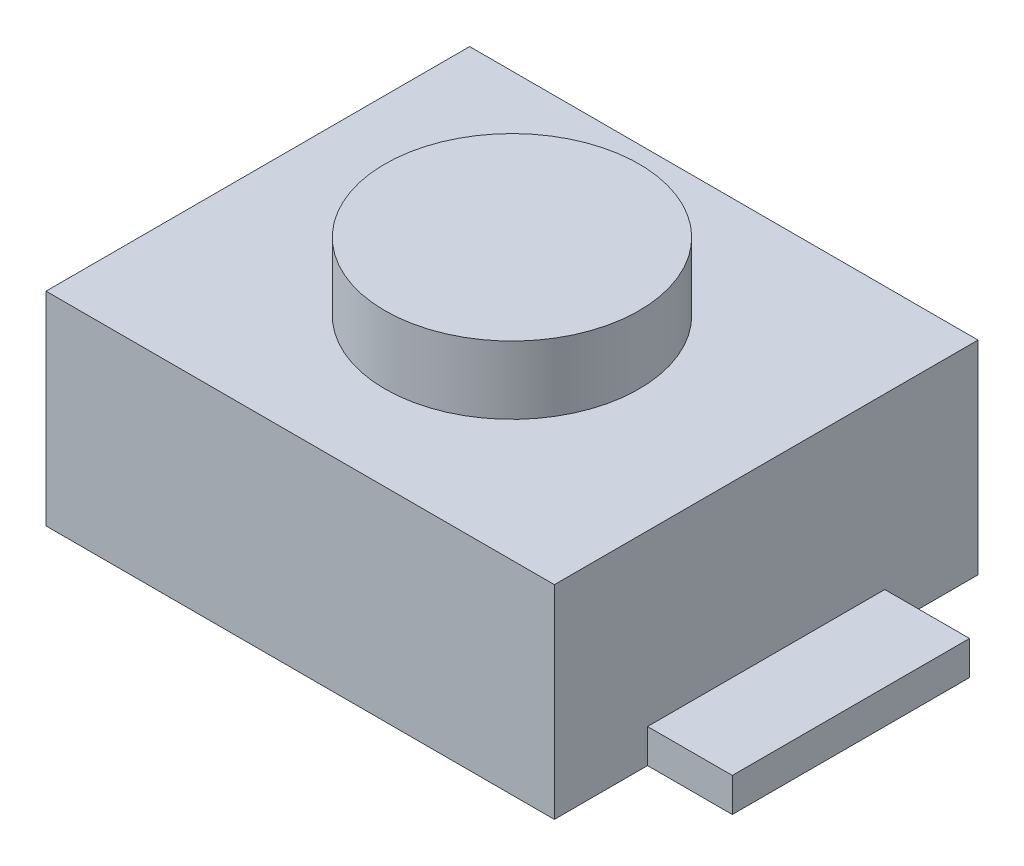
ISO-10303-21;
HEADER;
FILE_DESCRIPTION(('STEP AP214'),'2;1');
FILE_NAME('part.step','',(''),(''),'','','');
FILE_SCHEMA(('AUTOMOTIVE_DESIGN { 1 0 10303 214 1 1 1 1 }'));
ENDSEC;
DATA;
#1=APPLICATION_CONTEXT('core data for automotive mechanical design processes');
#2=APPLICATION_PROTOCOL_DEFINITION('international standard','automotive_design',2000,#1);
#3=PRODUCT_CONTEXT('',#1,'mechanical');
#4=PRODUCT('Part','Part','',(#3));
#5=PRODUCT_RELATED_PRODUCT_CATEGORY('part','',(#4));
#6=PRODUCT_DEFINITION_FORMATION('','',#4);
#7=PRODUCT_DEFINITION_CONTEXT('part definition',#1,'design');
#8=PRODUCT_DEFINITION('design','',#6,#7);
#9=PRODUCT_DEFINITION_SHAPE('','',#8);
#10=(LENGTH_UNIT() NAMED_UNIT(*) SI_UNIT(.MILLI.,.METRE.));
#11=(NAMED_UNIT(*) PLANE_ANGLE_UNIT() SI_UNIT($,.RADIAN.));
#12=(NAMED_UNIT(*) SI_UNIT($,.STERADIAN.) SOLID_ANGLE_UNIT());
#13=UNCERTAINTY_MEASURE_WITH_UNIT(LENGTH_MEASURE(1.E-05),#10,'distance_accuracy_value','');
#14=(GEOMETRIC_REPRESENTATION_CONTEXT(3) GLOBAL_UNCERTAINTY_ASSIGNED_CONTEXT((#13)) GLOBAL_UNIT_ASSIGNED_CONTEXT((#10,
#11,#12)) REPRESENTATION_CONTEXT('',''));
#15=CARTESIAN_POINT('',(0.,0.,0.));
#16=DIRECTION('',(0.,0.,1.));
#17=DIRECTION('',(1.,0.,0.));
#18=AXIS2_PLACEMENT_3D('',#15,#16,#17);
#19=CARTESIAN_POINT('',(-1.5,1.2,-1.25));
#20=DIRECTION('',(0.,0.,-1.));
#21=DIRECTION('',(-1.,0.,0.));
#22=AXIS2_PLACEMENT_3D('',#19,#20,#21);
#23=PLANE('',#22);
#24=DIRECTION('',(1.,0.,0.));
#25=VECTOR('',#24,1.);
#26=CARTESIAN_POINT('',(-1.5,0.,-1.25));
#27=LINE('',#26,#25);
#28=CARTESIAN_POINT('',(-1.5,0.,-1.25));
#29=VERTEX_POINT('',#28);
#30=CARTESIAN_POINT('',(1.5,0.,-1.25));
#31=VERTEX_POINT('',#30);
#32=EDGE_CURVE('E209',#29,#31,#27,.T.);
#33=ORIENTED_EDGE('',*,*,#32,.F.);
#34=DIRECTION('',(0.,-1.,0.));
#35=VECTOR('',#34,1.);
#36=CARTESIAN_POINT('',(-1.5,1.2,-1.25));
#37=LINE('',#36,#35);
#38=CARTESIAN_POINT('',(-1.5,1.2,-1.25));
#39=VERTEX_POINT('',#38);
#40=EDGE_CURVE('E11',#39,#29,#37,.T.);
#41=ORIENTED_EDGE('',*,*,#40,.F.);
#42=DIRECTION('',(1.,0.,0.));
#43=VECTOR('',#42,1.);
#44=CARTESIAN_POINT('',(-1.5,1.2,-1.25));
#45=LINE('',#44,#43);
#46=CARTESIAN_POINT('',(1.5,1.2,-1.25));
#47=VERTEX_POINT('',#46);
#48=EDGE_CURVE('E192',#39,#47,#45,.T.);
#49=ORIENTED_EDGE('',*,*,#48,.T.);
#50=DIRECTION('',(0.,-1.,0.));
#51=VECTOR('',#50,1.);
#52=CARTESIAN_POINT('',(1.5,1.2,-1.25));
#53=LINE('',#52,#51);
#54=EDGE_CURVE('E203',#47,#31,#53,.T.);
#55=ORIENTED_EDGE('',*,*,#54,.T.);
#56=EDGE_LOOP('',(#33,#41,#49,#55));
#57=FACE_BOUND('',#56,.T.);
#58=ADVANCED_FACE('F32',(#57),#23,.T.);
#59=CARTESIAN_POINT('',(-1.5,1.2,1.25));
#60=DIRECTION('',(-1.,0.,0.));
#61=DIRECTION('',(0.,0.,1.));
#62=AXIS2_PLACEMENT_3D('',#59,#60,#61);
#63=PLANE('',#62);
#64=DIRECTION('',(0.,1.,0.));
#65=VECTOR('',#64,1.);
#66=CARTESIAN_POINT('',(-1.5,0.2,0.7));
#67=LINE('',#66,#65);
#68=CARTESIAN_POINT('',(-1.5,0.,0.7));
#69=VERTEX_POINT('',#68);
#70=CARTESIAN_POINT('',(-1.5,0.2,0.7));
#71=VERTEX_POINT('',#70);
#72=EDGE_CURVE('E142',#69,#71,#67,.T.);
#73=ORIENTED_EDGE('',*,*,#72,.F.);
#74=DIRECTION('',(0.,0.,-1.));
#75=VECTOR('',#74,1.);
#76=CARTESIAN_POINT('',(-1.5,0.,1.25));
#77=LINE('',#76,#75);
#78=CARTESIAN_POINT('',(-1.5,0.,1.25));
#79=VERTEX_POINT('',#78);
#80=EDGE_CURVE('E188',#79,#69,#77,.T.);
#81=ORIENTED_EDGE('',*,*,#80,.F.);
#82=DIRECTION('',(0.,-1.,0.));
#83=VECTOR('',#82,1.);
#84=CARTESIAN_POINT('',(-1.5,1.2,1.25));
#85=LINE('',#84,#83);
#86=CARTESIAN_POINT('',(-1.5,1.2,1.25));
#87=VERTEX_POINT('',#86);
#88=EDGE_CURVE('E40',#87,#79,#85,.T.);
#89=ORIENTED_EDGE('',*,*,#88,.F.);
#90=DIRECTION('',(0.,0.,-1.));
#91=VECTOR('',#90,1.);
#92=CARTESIAN_POINT('',(-1.5,1.2,1.25));
#93=LINE('',#92,#91);
#94=EDGE_CURVE('E204',#87,#39,#93,.T.);
#95=ORIENTED_EDGE('',*,*,#94,.T.);
#96=ORIENTED_EDGE('',*,*,#40,.T.);
#97=CARTESIAN_POINT('',(-1.5,0.,-0.7));
#98=VERTEX_POINT('',#97);
#99=EDGE_CURVE('E53',#98,#29,#77,.T.);
#100=ORIENTED_EDGE('',*,*,#99,.F.);
#101=DIRECTION('',(0.,-1.,0.));
#102=VECTOR('',#101,1.);
#103=CARTESIAN_POINT('',(-1.5,0.,-0.7));
#104=LINE('',#103,#102);
#105=CARTESIAN_POINT('',(-1.5,0.2,-0.7));
#106=VERTEX_POINT('',#105);
#107=EDGE_CURVE('E139',#106,#98,#104,.T.);
#108=ORIENTED_EDGE('',*,*,#107,.F.);
#109=DIRECTION('',(0.,0.,-1.));
#110=VECTOR('',#109,1.);
#111=CARTESIAN_POINT('',(-1.5,0.2,-0.7));
#112=LINE('',#111,#110);
#113=EDGE_CURVE('E48',#71,#106,#112,.T.);
#114=ORIENTED_EDGE('',*,*,#113,.F.);
#115=EDGE_LOOP('',(#73,#81,#89,#95,#96,#100,#108,#114));
#116=FACE_BOUND('',#115,.T.);
#117=ADVANCED_FACE('F250',(#116),#63,.T.);
#118=CARTESIAN_POINT('',(1.5,1.2,1.25));
#119=DIRECTION('',(0.,0.,1.));
#120=DIRECTION('',(1.,0.,0.));
#121=AXIS2_PLACEMENT_3D('',#118,#119,#120);
#122=PLANE('',#121);
#123=DIRECTION('',(-1.,0.,0.));
#124=VECTOR('',#123,1.);
#125=CARTESIAN_POINT('',(1.5,0.,1.25));
#126=LINE('',#125,#124);
#127=CARTESIAN_POINT('',(1.5,0.,1.25));
#128=VERTEX_POINT('',#127);
#129=EDGE_CURVE('E196',#128,#79,#126,.T.);
#130=ORIENTED_EDGE('',*,*,#129,.F.);
#131=DIRECTION('',(0.,-1.,0.));
#132=VECTOR('',#131,1.);
#133=CARTESIAN_POINT('',(1.5,1.2,1.25));
#134=LINE('',#133,#132);
#135=CARTESIAN_POINT('',(1.5,1.2,1.25));
#136=VERTEX_POINT('',#135);
#137=EDGE_CURVE('E200',#136,#128,#134,.T.);
#138=ORIENTED_EDGE('',*,*,#137,.F.);
#139=DIRECTION('',(-1.,0.,0.));
#140=VECTOR('',#139,1.);
#141=CARTESIAN_POINT('',(1.5,1.2,1.25));
#142=LINE('',#141,#140);
#143=EDGE_CURVE('E215',#136,#87,#142,.T.);
#144=ORIENTED_EDGE('',*,*,#143,.T.);
#145=ORIENTED_EDGE('',*,*,#88,.T.);
#146=EDGE_LOOP('',(#130,#138,#144,#145));
#147=FACE_BOUND('',#146,.T.);
#148=ADVANCED_FACE('F255',(#147),#122,.T.);
#149=CARTESIAN_POINT('',(1.5,1.2,-1.25));
#150=DIRECTION('',(1.,0.,0.));
#151=DIRECTION('',(0.,0.,-1.));
#152=AXIS2_PLACEMENT_3D('',#149,#150,#151);
#153=PLANE('',#152);
#154=DIRECTION('',(0.,1.,0.));
#155=VECTOR('',#154,1.);
#156=CARTESIAN_POINT('',(1.5,0.2,-0.7));
#157=LINE('',#156,#155);
#158=CARTESIAN_POINT('',(1.5,0.,-0.7));
#159=VERTEX_POINT('',#158);
#160=CARTESIAN_POINT('',(1.5,0.2,-0.7));
#161=VERTEX_POINT('',#160);
#162=EDGE_CURVE('E156',#159,#161,#157,.T.);
#163=ORIENTED_EDGE('',*,*,#162,.F.);
#164=DIRECTION('',(0.,0.,1.));
#165=VECTOR('',#164,1.);
#166=CARTESIAN_POINT('',(1.5,0.,-1.25));
#167=LINE('',#166,#165);
#168=EDGE_CURVE('E205',#31,#159,#167,.T.);
#169=ORIENTED_EDGE('',*,*,#168,.F.);
#170=ORIENTED_EDGE('',*,*,#54,.F.);
#171=DIRECTION('',(0.,0.,1.));
#172=VECTOR('',#171,1.);
#173=CARTESIAN_POINT('',(1.5,1.2,-1.25));
#174=LINE('',#173,#172);
#175=EDGE_CURVE('E218',#47,#136,#174,.T.);
#176=ORIENTED_EDGE('',*,*,#175,.T.);
#177=ORIENTED_EDGE('',*,*,#137,.T.);
#178=CARTESIAN_POINT('',(1.5,0.,0.7));
#179=VERTEX_POINT('',#178);
#180=EDGE_CURVE('E170',#179,#128,#167,.T.);
#181=ORIENTED_EDGE('',*,*,#180,.F.);
#182=DIRECTION('',(0.,-1.,0.));
#183=VECTOR('',#182,1.);
#184=CARTESIAN_POINT('',(1.5,0.,0.7));
#185=LINE('',#184,#183);
#186=CARTESIAN_POINT('',(1.5,0.2,0.7));
#187=VERTEX_POINT('',#186);
#188=EDGE_CURVE('E146',#187,#179,#185,.T.);
#189=ORIENTED_EDGE('',*,*,#188,.F.);
#190=DIRECTION('',(0.,0.,1.));
#191=VECTOR('',#190,1.);
#192=CARTESIAN_POINT('',(1.5,0.2,0.7));
#193=LINE('',#192,#191);
#194=EDGE_CURVE('E143',#161,#187,#193,.T.);
#195=ORIENTED_EDGE('',*,*,#194,.F.);
#196=EDGE_LOOP('',(#163,#169,#170,#176,#177,#181,#189,#195));
#197=FACE_BOUND('',#196,.T.);
#198=ADVANCED_FACE('F233',(#197),#153,.T.);
#199=CARTESIAN_POINT('',(1.5,1.2,-1.25));
#200=DIRECTION('',(0.,-1.,0.));
#201=DIRECTION('',(0.,0.,-1.));
#202=AXIS2_PLACEMENT_3D('',#199,#200,#201);
#203=PLANE('',#202);
#204=CARTESIAN_POINT('',(0.,1.2,0.));
#205=DIRECTION('',(0.,1.,0.));
#206=DIRECTION('',(0.,0.,1.));
#207=AXIS2_PLACEMENT_3D('',#204,#205,#206);
#208=CIRCLE('',#207,0.75);
#209=CARTESIAN_POINT('',(0.,1.2,0.75));
#210=VERTEX_POINT('',#209);
#211=EDGE_CURVE('E269',#210,#210,#208,.T.);
#212=ORIENTED_EDGE('',*,*,#211,.F.);
#213=EDGE_LOOP('',(#212));
#214=FACE_BOUND('',#213,.T.);
#215=ORIENTED_EDGE('',*,*,#48,.F.);
#216=ORIENTED_EDGE('',*,*,#94,.F.);
#217=ORIENTED_EDGE('',*,*,#143,.F.);
#218=ORIENTED_EDGE('',*,*,#175,.F.);
#219=EDGE_LOOP('',(#215,#216,#217,#218));
#220=FACE_BOUND('',#219,.T.);
#221=ADVANCED_FACE('F248',(#214,#220),#203,.F.);
#222=CARTESIAN_POINT('',(1.5,0.,-1.25));
#223=DIRECTION('',(0.,-1.,0.));
#224=DIRECTION('',(0.,0.,-1.));
#225=AXIS2_PLACEMENT_3D('',#222,#223,#224);
#226=PLANE('',#225);
#227=ORIENTED_EDGE('',*,*,#32,.T.);
#228=ORIENTED_EDGE('',*,*,#168,.T.);
#229=DIRECTION('',(-1.,0.,0.));
#230=VECTOR('',#229,1.);
#231=CARTESIAN_POINT('',(2.,0.,-0.7));
#232=LINE('',#231,#230);
#233=CARTESIAN_POINT('',(2.,0.,-0.7));
#234=VERTEX_POINT('',#233);
#235=EDGE_CURVE('E177',#234,#159,#232,.T.);
#236=ORIENTED_EDGE('',*,*,#235,.F.);
#237=DIRECTION('',(0.,0.,-1.));
#238=VECTOR('',#237,1.);
#239=CARTESIAN_POINT('',(2.,0.,-0.7));
#240=LINE('',#239,#238);
#241=CARTESIAN_POINT('',(2.,0.,0.7));
#242=VERTEX_POINT('',#241);
#243=EDGE_CURVE('E158',#242,#234,#240,.T.);
#244=ORIENTED_EDGE('',*,*,#243,.F.);
#245=DIRECTION('',(-1.,0.,0.));
#246=VECTOR('',#245,1.);
#247=CARTESIAN_POINT('',(2.,0.,0.7));
#248=LINE('',#247,#246);
#249=EDGE_CURVE('E173',#242,#179,#248,.T.);
#250=ORIENTED_EDGE('',*,*,#249,.T.);
#251=ORIENTED_EDGE('',*,*,#180,.T.);
#252=ORIENTED_EDGE('',*,*,#129,.T.);
#253=ORIENTED_EDGE('',*,*,#80,.T.);
#254=DIRECTION('',(1.,0.,0.));
#255=VECTOR('',#254,1.);
#256=CARTESIAN_POINT('',(-2.,0.,0.7));
#257=LINE('',#256,#255);
#258=CARTESIAN_POINT('',(-2.,0.,0.7));
#259=VERTEX_POINT('',#258);
#260=EDGE_CURVE('E259',#259,#69,#257,.T.);
#261=ORIENTED_EDGE('',*,*,#260,.F.);
#262=DIRECTION('',(0.,0.,1.));
#263=VECTOR('',#262,1.);
#264=CARTESIAN_POINT('',(-2.,0.,0.7));
#265=LINE('',#264,#263);
#266=CARTESIAN_POINT('',(-2.,0.,-0.7));
#267=VERTEX_POINT('',#266);
#268=EDGE_CURVE('E135',#267,#259,#265,.T.);
#269=ORIENTED_EDGE('',*,*,#268,.F.);
#270=DIRECTION('',(1.,0.,0.));
#271=VECTOR('',#270,1.);
#272=CARTESIAN_POINT('',(-2.,0.,-0.7));
#273=LINE('',#272,#271);
#274=EDGE_CURVE('E148',#267,#98,#273,.T.);
#275=ORIENTED_EDGE('',*,*,#274,.T.);
#276=ORIENTED_EDGE('',*,*,#99,.T.);
#277=EDGE_LOOP('',(#227,#228,#236,#244,#250,#251,#252,#253,#261,#269,#275,#276));
#278=FACE_BOUND('',#277,.T.);
#279=ADVANCED_FACE('F241',(#278),#226,.T.);
#280=CARTESIAN_POINT('',(2.,0.2,0.7));
#281=DIRECTION('',(0.,-1.,0.));
#282=DIRECTION('',(0.,0.,-1.));
#283=AXIS2_PLACEMENT_3D('',#280,#281,#282);
#284=PLANE('',#283);
#285=ORIENTED_EDGE('',*,*,#194,.T.);
#286=DIRECTION('',(-1.,0.,0.));
#287=VECTOR('',#286,1.);
#288=CARTESIAN_POINT('',(2.,0.2,0.7));
#289=LINE('',#288,#287);
#290=CARTESIAN_POINT('',(2.,0.2,0.7));
#291=VERTEX_POINT('',#290);
#292=EDGE_CURVE('E176',#291,#187,#289,.T.);
#293=ORIENTED_EDGE('',*,*,#292,.F.);
#294=DIRECTION('',(0.,0.,1.));
#295=VECTOR('',#294,1.);
#296=CARTESIAN_POINT('',(2.,0.2,0.7));
#297=LINE('',#296,#295);
#298=CARTESIAN_POINT('',(2.,0.2,-0.7));
#299=VERTEX_POINT('',#298);
#300=EDGE_CURVE('E152',#299,#291,#297,.T.);
#301=ORIENTED_EDGE('',*,*,#300,.F.);
#302=DIRECTION('',(-1.,0.,0.));
#303=VECTOR('',#302,1.);
#304=CARTESIAN_POINT('',(2.,0.2,-0.7));
#305=LINE('',#304,#303);
#306=EDGE_CURVE('E161',#299,#161,#305,.T.);
#307=ORIENTED_EDGE('',*,*,#306,.T.);
#308=EDGE_LOOP('',(#285,#293,#301,#307));
#309=FACE_BOUND('',#308,.T.);
#310=ADVANCED_FACE('F230',(#309),#284,.F.);
#311=CARTESIAN_POINT('',(2.,0.,0.7));
#312=DIRECTION('',(0.,0.,-1.));
#313=DIRECTION('',(-1.,0.,0.));
#314=AXIS2_PLACEMENT_3D('',#311,#312,#313);
#315=PLANE('',#314);
#316=ORIENTED_EDGE('',*,*,#188,.T.);
#317=ORIENTED_EDGE('',*,*,#249,.F.);
#318=DIRECTION('',(0.,-1.,0.));
#319=VECTOR('',#318,1.);
#320=CARTESIAN_POINT('',(2.,0.,0.7));
#321=LINE('',#320,#319);
#322=EDGE_CURVE('E155',#291,#242,#321,.T.);
#323=ORIENTED_EDGE('',*,*,#322,.F.);
#324=ORIENTED_EDGE('',*,*,#292,.T.);
#325=EDGE_LOOP('',(#316,#317,#323,#324));
#326=FACE_BOUND('',#325,.T.);
#327=ADVANCED_FACE('F225',(#326),#315,.F.);
#328=CARTESIAN_POINT('',(2.,0.2,-0.7));
#329=DIRECTION('',(0.,0.,1.));
#330=DIRECTION('',(1.,0.,0.));
#331=AXIS2_PLACEMENT_3D('',#328,#329,#330);
#332=PLANE('',#331);
#333=ORIENTED_EDGE('',*,*,#162,.T.);
#334=ORIENTED_EDGE('',*,*,#306,.F.);
#335=DIRECTION('',(0.,1.,0.));
#336=VECTOR('',#335,1.);
#337=CARTESIAN_POINT('',(2.,0.2,-0.7));
#338=LINE('',#337,#336);
#339=EDGE_CURVE('E160',#234,#299,#338,.T.);
#340=ORIENTED_EDGE('',*,*,#339,.F.);
#341=ORIENTED_EDGE('',*,*,#235,.T.);
#342=EDGE_LOOP('',(#333,#334,#340,#341));
#343=FACE_BOUND('',#342,.T.);
#344=ADVANCED_FACE('F236',(#343),#332,.F.);
#345=CARTESIAN_POINT('',(2.,0.2,-0.7));
#346=DIRECTION('',(-1.,0.,0.));
#347=DIRECTION('',(0.,0.,1.));
#348=AXIS2_PLACEMENT_3D('',#345,#346,#347);
#349=PLANE('',#348);
#350=ORIENTED_EDGE('',*,*,#300,.T.);
#351=ORIENTED_EDGE('',*,*,#322,.T.);
#352=ORIENTED_EDGE('',*,*,#243,.T.);
#353=ORIENTED_EDGE('',*,*,#339,.T.);
#354=EDGE_LOOP('',(#350,#351,#352,#353));
#355=FACE_BOUND('',#354,.T.);
#356=ADVANCED_FACE('F316',(#355),#349,.F.);
#357=CARTESIAN_POINT('',(-2.,0.2,0.7));
#358=DIRECTION('',(0.,0.,-1.));
#359=DIRECTION('',(-1.,0.,0.));
#360=AXIS2_PLACEMENT_3D('',#357,#358,#359);
#361=PLANE('',#360);
#362=ORIENTED_EDGE('',*,*,#72,.T.);
#363=DIRECTION('',(1.,0.,0.));
#364=VECTOR('',#363,1.);
#365=CARTESIAN_POINT('',(-2.,0.2,0.7));
#366=LINE('',#365,#364);
#367=CARTESIAN_POINT('',(-2.,0.2,0.7));
#368=VERTEX_POINT('',#367);
#369=EDGE_CURVE('E123',#368,#71,#366,.T.);
#370=ORIENTED_EDGE('',*,*,#369,.F.);
#371=DIRECTION('',(0.,1.,0.));
#372=VECTOR('',#371,1.);
#373=CARTESIAN_POINT('',(-2.,0.2,0.7));
#374=LINE('',#373,#372);
#375=EDGE_CURVE('E130',#259,#368,#374,.T.);
#376=ORIENTED_EDGE('',*,*,#375,.F.);
#377=ORIENTED_EDGE('',*,*,#260,.T.);
#378=EDGE_LOOP('',(#362,#370,#376,#377));
#379=FACE_BOUND('',#378,.T.);
#380=ADVANCED_FACE('F141',(#379),#361,.F.);
#381=CARTESIAN_POINT('',(-2.,0.2,-0.7));
#382=DIRECTION('',(0.,-1.,0.));
#383=DIRECTION('',(0.,0.,-1.));
#384=AXIS2_PLACEMENT_3D('',#381,#382,#383);
#385=PLANE('',#384);
#386=ORIENTED_EDGE('',*,*,#113,.T.);
#387=DIRECTION('',(1.,0.,0.));
#388=VECTOR('',#387,1.);
#389=CARTESIAN_POINT('',(-2.,0.2,-0.7));
#390=LINE('',#389,#388);
#391=CARTESIAN_POINT('',(-2.,0.2,-0.7));
#392=VERTEX_POINT('',#391);
#393=EDGE_CURVE('E126',#392,#106,#390,.T.);
#394=ORIENTED_EDGE('',*,*,#393,.F.);
#395=DIRECTION('',(0.,0.,-1.));
#396=VECTOR('',#395,1.);
#397=CARTESIAN_POINT('',(-2.,0.2,-0.7));
#398=LINE('',#397,#396);
#399=EDGE_CURVE('E119',#368,#392,#398,.T.);
#400=ORIENTED_EDGE('',*,*,#399,.F.);
#401=ORIENTED_EDGE('',*,*,#369,.T.);
#402=EDGE_LOOP('',(#386,#394,#400,#401));
#403=FACE_BOUND('',#402,.T.);
#404=ADVANCED_FACE('F121',(#403),#385,.F.);
#405=CARTESIAN_POINT('',(-2.,0.,-0.7));
#406=DIRECTION('',(0.,0.,1.));
#407=DIRECTION('',(1.,0.,0.));
#408=AXIS2_PLACEMENT_3D('',#405,#406,#407);
#409=PLANE('',#408);
#410=ORIENTED_EDGE('',*,*,#107,.T.);
#411=ORIENTED_EDGE('',*,*,#274,.F.);
#412=DIRECTION('',(0.,-1.,0.));
#413=VECTOR('',#412,1.);
#414=CARTESIAN_POINT('',(-2.,0.,-0.7));
#415=LINE('',#414,#413);
#416=EDGE_CURVE('E129',#392,#267,#415,.T.);
#417=ORIENTED_EDGE('',*,*,#416,.F.);
#418=ORIENTED_EDGE('',*,*,#393,.T.);
#419=EDGE_LOOP('',(#410,#411,#417,#418));
#420=FACE_BOUND('',#419,.T.);
#421=ADVANCED_FACE('F287',(#420),#409,.F.);
#422=CARTESIAN_POINT('',(-2.,0.,0.7));
#423=DIRECTION('',(1.,0.,0.));
#424=DIRECTION('',(0.,0.,-1.));
#425=AXIS2_PLACEMENT_3D('',#422,#423,#424);
#426=PLANE('',#425);
#427=ORIENTED_EDGE('',*,*,#375,.T.);
#428=ORIENTED_EDGE('',*,*,#399,.T.);
#429=ORIENTED_EDGE('',*,*,#416,.T.);
#430=ORIENTED_EDGE('',*,*,#268,.T.);
#431=EDGE_LOOP('',(#427,#428,#429,#430));
#432=FACE_BOUND('',#431,.T.);
#433=ADVANCED_FACE('F133',(#432),#426,.F.);
#434=CARTESIAN_POINT('',(0.,1.2,0.));
#435=DIRECTION('',(0.,1.,0.));
#436=DIRECTION('',(0.,0.,1.));
#437=AXIS2_PLACEMENT_3D('',#434,#435,#436);
#438=CYLINDRICAL_SURFACE('',#437,0.75);
#439=ORIENTED_EDGE('',*,*,#211,.T.);
#440=EDGE_LOOP('',(#439));
#441=FACE_BOUND('',#440,.T.);
#442=CARTESIAN_POINT('',(0.,1.6,0.));
#443=DIRECTION('',(0.,1.,0.));
#444=DIRECTION('',(0.,0.,1.));
#445=AXIS2_PLACEMENT_3D('',#442,#443,#444);
#446=CIRCLE('',#445,0.75);
#447=CARTESIAN_POINT('',(0.,1.6,0.75));
#448=VERTEX_POINT('',#447);
#449=EDGE_CURVE('E272',#448,#448,#446,.T.);
#450=ORIENTED_EDGE('',*,*,#449,.F.);
#451=EDGE_LOOP('',(#450));
#452=FACE_BOUND('',#451,.T.);
#453=ADVANCED_FACE('F278',(#441,#452),#438,.T.);
#454=CARTESIAN_POINT('',(0.,1.6,0.));
#455=DIRECTION('',(0.,1.,0.));
#456=DIRECTION('',(0.,0.,1.));
#457=AXIS2_PLACEMENT_3D('',#454,#455,#456);
#458=PLANE('',#457);
#459=ORIENTED_EDGE('',*,*,#449,.T.);
#460=EDGE_LOOP('',(#459));
#461=FACE_BOUND('',#460,.T.);
#462=ADVANCED_FACE('F276',(#461),#458,.T.);
#463=CLOSED_SHELL('',(#58,#117,#148,#198,#221,#279,#310,#327,#344,#356,#380,#404,#421,#433,#453,#462));
#464=MANIFOLD_SOLID_BREP('B2',#463);
#465=ADVANCED_BREP_SHAPE_REPRESENTATION('',(#18,#464),#14);
#466=SHAPE_DEFINITION_REPRESENTATION(#9,#465);
ENDSEC;
END-ISO-10303-21;
